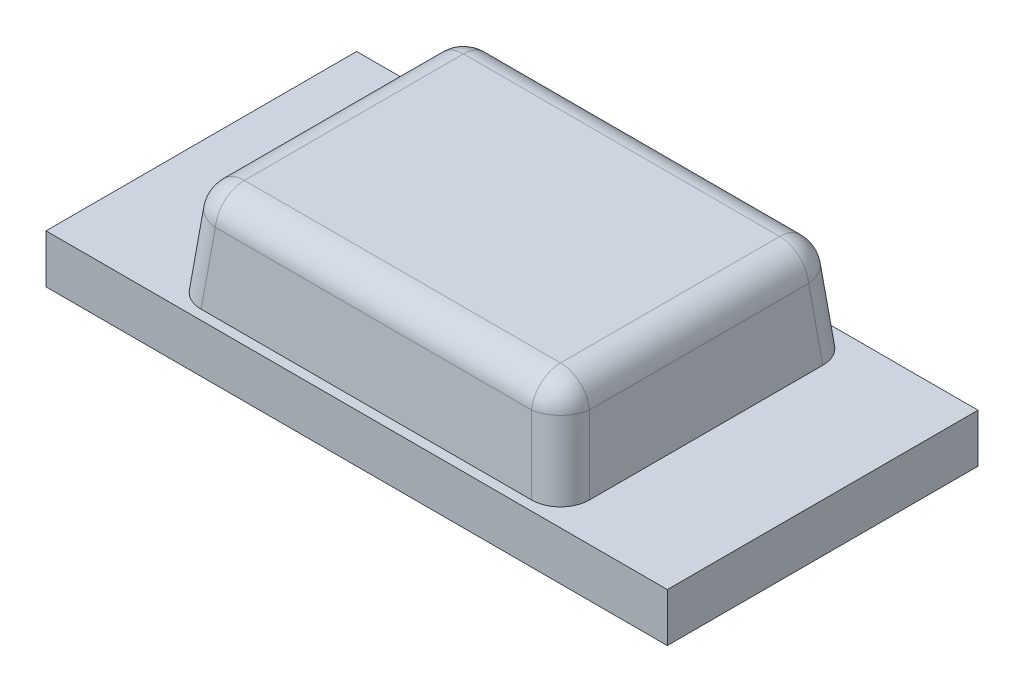
ISO-10303-21;
HEADER;
FILE_DESCRIPTION(('STEP AP214'),'2;1');
FILE_NAME('part.step','',(''),(''),'','','');
FILE_SCHEMA(('AUTOMOTIVE_DESIGN { 1 0 10303 214 1 1 1 1 }'));
ENDSEC;
DATA;
#1=APPLICATION_CONTEXT('core data for automotive mechanical design processes');
#2=APPLICATION_PROTOCOL_DEFINITION('international standard','automotive_design',2000,#1);
#3=PRODUCT_CONTEXT('',#1,'mechanical');
#4=PRODUCT('Part','Part','',(#3));
#5=PRODUCT_RELATED_PRODUCT_CATEGORY('part','',(#4));
#6=PRODUCT_DEFINITION_FORMATION('','',#4);
#7=PRODUCT_DEFINITION_CONTEXT('part definition',#1,'design');
#8=PRODUCT_DEFINITION('design','',#6,#7);
#9=PRODUCT_DEFINITION_SHAPE('','',#8);
#10=(LENGTH_UNIT() NAMED_UNIT(*) SI_UNIT(.MILLI.,.METRE.));
#11=(NAMED_UNIT(*) PLANE_ANGLE_UNIT() SI_UNIT($,.RADIAN.));
#12=(NAMED_UNIT(*) SI_UNIT($,.STERADIAN.) SOLID_ANGLE_UNIT());
#13=UNCERTAINTY_MEASURE_WITH_UNIT(LENGTH_MEASURE(1.E-05),#10,'distance_accuracy_value','');
#14=(GEOMETRIC_REPRESENTATION_CONTEXT(3) GLOBAL_UNCERTAINTY_ASSIGNED_CONTEXT((#13)) GLOBAL_UNIT_ASSIGNED_CONTEXT((#10,
#11,#12)) REPRESENTATION_CONTEXT('',''));
#15=CARTESIAN_POINT('',(0.,0.,0.));
#16=DIRECTION('',(0.,0.,1.));
#17=DIRECTION('',(1.,0.,0.));
#18=AXIS2_PLACEMENT_3D('',#15,#16,#17);
#19=CARTESIAN_POINT('',(-0.814255681,0.75,0.564255681));
#20=DIRECTION('',(0.,-1.,0.));
#21=DIRECTION('',(0.,0.,-1.));
#22=AXIS2_PLACEMENT_3D('',#19,#20,#21);
#23=PLANE('',#22);
#24=DIRECTION('',(-1.,0.,0.));
#25=VECTOR('',#24,1.);
#26=CARTESIAN_POINT('',(0.,0.75,0.564255680969235));
#27=LINE('',#26,#25);
#28=CARTESIAN_POINT('',(-0.814255681058048,0.749999999941955,0.56425568061731));
#29=VERTEX_POINT('',#28);
#30=CARTESIAN_POINT('',(0.814255680918878,0.750000000058046,0.564255680741093));
#31=VERTEX_POINT('',#30);
#32=EDGE_CURVE('E152',#29,#31,#27,.F.);
#33=ORIENTED_EDGE('',*,*,#32,.T.);
#34=DIRECTION('',(0.,0.,1.));
#35=VECTOR('',#34,1.);
#36=CARTESIAN_POINT('',(0.814255680969235,0.75,0.));
#37=LINE('',#36,#35);
#38=CARTESIAN_POINT('',(0.814255680984617,0.75,-0.564255681168272));
#39=VERTEX_POINT('',#38);
#40=EDGE_CURVE('E106',#31,#39,#37,.F.);
#41=ORIENTED_EDGE('',*,*,#40,.T.);
#42=DIRECTION('',(1.,0.,0.));
#43=VECTOR('',#42,1.);
#44=CARTESIAN_POINT('',(0.,0.75,-0.564255680969235));
#45=LINE('',#44,#43);
#46=CARTESIAN_POINT('',(-0.814255680934262,0.749999999941955,-0.56425568147571));
#47=VERTEX_POINT('',#46);
#48=EDGE_CURVE('E191',#39,#47,#45,.F.);
#49=ORIENTED_EDGE('',*,*,#48,.T.);
#50=DIRECTION('',(0.,0.,-1.));
#51=VECTOR('',#50,1.);
#52=CARTESIAN_POINT('',(-0.814255680969235,0.75,0.));
#53=LINE('',#52,#51);
#54=EDGE_CURVE('E163',#47,#29,#53,.F.);
#55=ORIENTED_EDGE('',*,*,#54,.T.);
#56=EDGE_LOOP('',(#33,#41,#49,#55));
#57=FACE_BOUND('',#56,.T.);
#58=ADVANCED_FACE('F17',(#57),#23,.F.);
#59=CARTESIAN_POINT('',(-1.6,0.,0.8));
#60=DIRECTION('',(0.,-1.,0.));
#61=DIRECTION('',(0.,0.,-1.));
#62=AXIS2_PLACEMENT_3D('',#59,#60,#61);
#63=PLANE('',#62);
#64=DIRECTION('',(0.,0.,-1.));
#65=VECTOR('',#64,1.);
#66=CARTESIAN_POINT('',(-1.6,0.,0.));
#67=LINE('',#66,#65);
#68=CARTESIAN_POINT('',(-1.6,0.,0.8));
#69=VERTEX_POINT('',#68);
#70=CARTESIAN_POINT('',(-1.6,0.,-0.8));
#71=VERTEX_POINT('',#70);
#72=EDGE_CURVE('E278',#69,#71,#67,.T.);
#73=ORIENTED_EDGE('',*,*,#72,.T.);
#74=DIRECTION('',(1.,0.,0.));
#75=VECTOR('',#74,1.);
#76=CARTESIAN_POINT('',(0.,0.,-0.8));
#77=LINE('',#76,#75);
#78=CARTESIAN_POINT('',(1.6,0.,-0.8));
#79=VERTEX_POINT('',#78);
#80=EDGE_CURVE('E272',#71,#79,#77,.T.);
#81=ORIENTED_EDGE('',*,*,#80,.T.);
#82=DIRECTION('',(0.,0.,1.));
#83=VECTOR('',#82,1.);
#84=CARTESIAN_POINT('',(1.6,0.,0.));
#85=LINE('',#84,#83);
#86=CARTESIAN_POINT('',(1.6,0.,0.8));
#87=VERTEX_POINT('',#86);
#88=EDGE_CURVE('E188',#79,#87,#85,.T.);
#89=ORIENTED_EDGE('',*,*,#88,.T.);
#90=DIRECTION('',(-1.,0.,0.));
#91=VECTOR('',#90,1.);
#92=CARTESIAN_POINT('',(0.,0.,0.8));
#93=LINE('',#92,#91);
#94=EDGE_CURVE('E105',#87,#69,#93,.T.);
#95=ORIENTED_EDGE('',*,*,#94,.T.);
#96=EDGE_LOOP('',(#73,#81,#89,#95));
#97=FACE_BOUND('',#96,.T.);
#98=ADVANCED_FACE('F181',(#97),#63,.T.);
#99=CARTESIAN_POINT('',(0.814255681232186,0.599999999767813,-0.564255681000003));
#100=DIRECTION('',(0.,-1.,0.));
#101=DIRECTION('',(0.,0.,-1.));
#102=AXIS2_PLACEMENT_3D('',#99,#100,#101);
#103=CIRCLE('',#102,0.15);
#104=TRIMMED_CURVE('',#103,(PARAMETER_VALUE(0.)),(PARAMETER_VALUE(3.14159265513768)),.T.,.PARAMETER.);
#105=CARTESIAN_POINT('',(0.814255681,0.6,-0.564255681));
#106=DIRECTION('',(0.,0.,1.));
#107=AXIS1_PLACEMENT('',#105,#106);
#108=SURFACE_OF_REVOLUTION('',#104,#107);
#109=CARTESIAN_POINT('',(0.814255681,0.6,-0.564255681));
#110=DIRECTION('',(1.,0.,0.));
#111=DIRECTION('',(0.,0.,-1.));
#112=AXIS2_PLACEMENT_3D('',#109,#110,#111);
#113=CIRCLE('',#112,0.15);
#114=CARTESIAN_POINT('',(0.814255680633374,0.614924012842646,-0.713511414020103));
#115=VERTEX_POINT('',#114);
#116=EDGE_CURVE('E102',#115,#39,#113,.T.);
#117=ORIENTED_EDGE('',*,*,#116,.T.);
#118=CARTESIAN_POINT('',(0.814255681,0.6,-0.564255681));
#119=DIRECTION('',(0.,0.,1.));
#120=DIRECTION('',(1.,0.,0.));
#121=AXIS2_PLACEMENT_3D('',#118,#119,#120);
#122=CIRCLE('',#121,0.15);
#123=CARTESIAN_POINT('',(0.96351141371124,0.614924015887899,-0.56425568128876));
#124=VERTEX_POINT('',#123);
#125=EDGE_CURVE('E98',#39,#124,#122,.F.);
#126=ORIENTED_EDGE('',*,*,#125,.T.);
#127=CARTESIAN_POINT('',(0.814255681158414,0.600000000306793,-0.564255681158414));
#128=DIRECTION('',(0.0990046045619691,-0.990149572817691,-0.0990046045619693));
#129=DIRECTION('',(0.,0.0994934181898311,-0.995038220239255));
#130=AXIS2_PLACEMENT_3D('',#127,#128,#129);
#131=CIRCLE('',#130,0.149999999935247);
#132=EDGE_CURVE('E21',#124,#115,#131,.F.);
#133=ORIENTED_EDGE('',*,*,#132,.T.);
#134=EDGE_LOOP('',(#117,#126,#133));
#135=FACE_BOUND('',#134,.T.);
#136=ADVANCED_FACE('F99',(#135),#108,.T.);
#137=CARTESIAN_POINT('',(-0.814255681,0.6,-0.564255681));
#138=DIRECTION('',(1.,0.,0.));
#139=DIRECTION('',(0.,1.,0.));
#140=AXIS2_PLACEMENT_3D('',#137,#138,#139);
#141=CYLINDRICAL_SURFACE('',#140,0.15);
#142=DIRECTION('',(1.,0.,0.));
#143=VECTOR('',#142,1.);
#144=CARTESIAN_POINT('',(0.,0.614924013,-0.713511414));
#145=LINE('',#144,#143);
#146=CARTESIAN_POINT('',(-0.814255680898972,0.614924011980278,-0.713511414326909));
#147=VERTEX_POINT('',#146);
#148=EDGE_CURVE('E89',#147,#115,#145,.T.);
#149=ORIENTED_EDGE('',*,*,#148,.F.);
#150=CARTESIAN_POINT('',(-0.814255680767813,0.599999999767819,-0.564255681464371));
#151=DIRECTION('',(1.,2.05103206470726E-10,0.));
#152=DIRECTION('',(0.,0.,-1.));
#153=AXIS2_PLACEMENT_3D('',#150,#151,#152);
#154=CIRCLE('',#153,0.15);
#155=EDGE_CURVE('E168',#147,#47,#154,.T.);
#156=ORIENTED_EDGE('',*,*,#155,.T.);
#157=ORIENTED_EDGE('',*,*,#48,.F.);
#158=ORIENTED_EDGE('',*,*,#116,.F.);
#159=EDGE_LOOP('',(#149,#156,#157,#158));
#160=FACE_BOUND('',#159,.T.);
#161=ADVANCED_FACE('F173',(#160),#141,.T.);
#162=CARTESIAN_POINT('',(-0.814255681232181,0.599999999767813,-0.564255681464371));
#163=DIRECTION('',(0.,-1.,0.));
#164=DIRECTION('',(0.,0.,-1.));
#165=AXIS2_PLACEMENT_3D('',#162,#163,#164);
#166=CIRCLE('',#165,0.15);
#167=TRIMMED_CURVE('',#166,(PARAMETER_VALUE(1.54786050643452E-09)),
(PARAMETER_VALUE(3.14159265204191)),.T.,.PARAMETER.);
#168=CARTESIAN_POINT('',(-0.814255681,0.6,-0.564255681));
#169=DIRECTION('',(0.,0.,1.));
#170=AXIS1_PLACEMENT('',#168,#169);
#171=SURFACE_OF_REVOLUTION('',#167,#170);
#172=CARTESIAN_POINT('',(-0.814255681338493,0.600000000342957,-0.564255681338493));
#173=DIRECTION('',(-0.0990046045609888,-0.990149572817887,-0.0990046045609883));
#174=DIRECTION('',(0.995038220239354,-0.0994934181888359,0.));
#175=AXIS2_PLACEMENT_3D('',#172,#173,#174);
#176=CIRCLE('',#175,0.149999999752651);
#177=CARTESIAN_POINT('',(-0.963511414083085,0.614924012877534,-0.564255681285929));
#178=VERTEX_POINT('',#177);
#179=EDGE_CURVE('E160',#147,#178,#176,.F.);
#180=ORIENTED_EDGE('',*,*,#179,.T.);
#181=CARTESIAN_POINT('',(-0.814255681,0.6,-0.564255681));
#182=DIRECTION('',(0.,0.,-1.));
#183=DIRECTION('',(-1.,0.,0.));
#184=AXIS2_PLACEMENT_3D('',#181,#182,#183);
#185=CIRCLE('',#184,0.15);
#186=EDGE_CURVE('E153',#178,#47,#185,.T.);
#187=ORIENTED_EDGE('',*,*,#186,.T.);
#188=ORIENTED_EDGE('',*,*,#155,.F.);
#189=EDGE_LOOP('',(#180,#187,#188));
#190=FACE_BOUND('',#189,.T.);
#191=ADVANCED_FACE('F170',(#190),#171,.T.);
#192=CARTESIAN_POINT('',(-0.814255681,0.6,0.564255681));
#193=DIRECTION('',(0.,0.,-1.));
#194=DIRECTION('',(-1.,0.,0.));
#195=AXIS2_PLACEMENT_3D('',#192,#193,#194);
#196=CYLINDRICAL_SURFACE('',#195,0.15);
#197=DIRECTION('',(0.,0.,-1.));
#198=VECTOR('',#197,1.);
#199=CARTESIAN_POINT('',(-0.963511414,0.614924013,0.));
#200=LINE('',#199,#198);
#201=CARTESIAN_POINT('',(-0.963511413796526,0.614924012631087,0.564255683016812));
#202=VERTEX_POINT('',#201);
#203=EDGE_CURVE('E156',#202,#178,#200,.T.);
#204=ORIENTED_EDGE('',*,*,#203,.F.);
#205=CARTESIAN_POINT('',(-0.814255681,0.6,0.56425567953077));
#206=DIRECTION('',(0.,0.,1.));
#207=DIRECTION('',(1.,1.54793351408977E-09,0.));
#208=AXIS2_PLACEMENT_3D('',#205,#206,#207);
#209=CIRCLE('',#208,0.149999999767819);
#210=EDGE_CURVE('E149',#202,#29,#209,.F.);
#211=ORIENTED_EDGE('',*,*,#210,.T.);
#212=ORIENTED_EDGE('',*,*,#54,.F.);
#213=ORIENTED_EDGE('',*,*,#186,.F.);
#214=EDGE_LOOP('',(#204,#211,#212,#213));
#215=FACE_BOUND('',#214,.T.);
#216=ADVANCED_FACE('F141',(#215),#196,.T.);
#217=CARTESIAN_POINT('',(-0.814255681232181,0.60000000023219,0.564255681000002));
#218=DIRECTION('',(0.,-1.,0.));
#219=DIRECTION('',(0.,0.,-1.));
#220=AXIS2_PLACEMENT_3D('',#217,#218,#219);
#221=CIRCLE('',#220,0.15);
#222=TRIMMED_CURVE('',#221,(PARAMETER_VALUE(1.54786050643452E-09)),
(PARAMETER_VALUE(3.14159265204191)),.T.,.PARAMETER.);
#223=CARTESIAN_POINT('',(-0.814255681,0.6,0.564255681));
#224=DIRECTION('',(0.,0.,1.));
#225=AXIS1_PLACEMENT('',#223,#224);
#226=SURFACE_OF_REVOLUTION('',#222,#225);
#227=CARTESIAN_POINT('',(-0.814255680755352,0.599999999675962,0.564255680755352));
#228=DIRECTION('',(-0.0990046045619691,-0.990149572817691,0.0990046045619691));
#229=DIRECTION('',(0.,-0.0994934181898309,-0.995038220239255));
#230=AXIS2_PLACEMENT_3D('',#227,#228,#229);
#231=CIRCLE('',#230,0.149999999533791);
#232=CARTESIAN_POINT('',(-0.814255683415363,0.614924012657866,0.713511413665788));
#233=VERTEX_POINT('',#232);
#234=EDGE_CURVE('E228',#202,#233,#231,.F.);
#235=ORIENTED_EDGE('',*,*,#234,.T.);
#236=CARTESIAN_POINT('',(-0.814255681,0.6,0.564255681));
#237=DIRECTION('',(-1.,0.,0.));
#238=DIRECTION('',(0.,0.,1.));
#239=AXIS2_PLACEMENT_3D('',#236,#237,#238);
#240=CIRCLE('',#239,0.15);
#241=EDGE_CURVE('E198',#233,#29,#240,.T.);
#242=ORIENTED_EDGE('',*,*,#241,.T.);
#243=ORIENTED_EDGE('',*,*,#210,.F.);
#244=EDGE_LOOP('',(#235,#242,#243));
#245=FACE_BOUND('',#244,.T.);
#246=ADVANCED_FACE('F136',(#245),#226,.T.);
#247=CARTESIAN_POINT('',(0.814255681,0.6,0.564255681));
#248=DIRECTION('',(-1.,0.,0.));
#249=DIRECTION('',(0.,-1.,0.));
#250=AXIS2_PLACEMENT_3D('',#247,#248,#249);
#251=CYLINDRICAL_SURFACE('',#250,0.15);
#252=DIRECTION('',(-1.,0.,0.));
#253=VECTOR('',#252,1.);
#254=CARTESIAN_POINT('',(0.,0.614924013,0.713511414));
#255=LINE('',#254,#253);
#256=CARTESIAN_POINT('',(0.814255683476164,0.614924012663885,0.713511413665186));
#257=VERTEX_POINT('',#256);
#258=EDGE_CURVE('E227',#257,#233,#255,.T.);
#259=ORIENTED_EDGE('',*,*,#258,.F.);
#260=CARTESIAN_POINT('',(0.81425568076781,0.600000000232186,0.564255681464368));
#261=DIRECTION('',(1.,2.05103206470726E-10,0.));
#262=DIRECTION('',(0.,0.,-1.));
#263=AXIS2_PLACEMENT_3D('',#260,#261,#262);
#264=CIRCLE('',#263,0.15);
#265=EDGE_CURVE('E118',#257,#31,#264,.F.);
#266=ORIENTED_EDGE('',*,*,#265,.T.);
#267=ORIENTED_EDGE('',*,*,#32,.F.);
#268=ORIENTED_EDGE('',*,*,#241,.F.);
#269=EDGE_LOOP('',(#259,#266,#267,#268));
#270=FACE_BOUND('',#269,.T.);
#271=ADVANCED_FACE('F131',(#270),#251,.T.);
#272=CARTESIAN_POINT('',(0.814255681232186,0.60000000023219,0.564255681464368));
#273=DIRECTION('',(0.,-1.,0.));
#274=DIRECTION('',(0.,0.,-1.));
#275=AXIS2_PLACEMENT_3D('',#272,#273,#274);
#276=CIRCLE('',#275,0.15);
#277=TRIMMED_CURVE('',#276,(PARAMETER_VALUE(0.)),(PARAMETER_VALUE(3.14159265513768)),.T.,.PARAMETER.);
#278=CARTESIAN_POINT('',(0.814255681,0.6,0.564255681));
#279=DIRECTION('',(0.,0.,1.));
#280=AXIS1_PLACEMENT('',#278,#279);
#281=SURFACE_OF_REVOLUTION('',#277,#280);
#282=CARTESIAN_POINT('',(0.814255681,0.6,0.564255681));
#283=DIRECTION('',(0.,0.,1.));
#284=DIRECTION('',(1.,0.,0.));
#285=AXIS2_PLACEMENT_3D('',#282,#283,#284);
#286=CIRCLE('',#285,0.15);
#287=CARTESIAN_POINT('',(0.963511413847012,0.614924012709589,0.564255683751427));
#288=VERTEX_POINT('',#287);
#289=EDGE_CURVE('E110',#288,#31,#286,.T.);
#290=ORIENTED_EDGE('',*,*,#289,.T.);
#291=ORIENTED_EDGE('',*,*,#265,.F.);
#292=CARTESIAN_POINT('',(0.814255680755352,0.599999999675962,0.564255680755352));
#293=DIRECTION('',(0.0990046045619691,-0.990149572817691,0.0990046045619691));
#294=DIRECTION('',(0.995038220239255,0.0994934181898309,0.));
#295=AXIS2_PLACEMENT_3D('',#292,#293,#294);
#296=CIRCLE('',#295,0.149999999533791);
#297=EDGE_CURVE('E95',#257,#288,#296,.F.);
#298=ORIENTED_EDGE('',*,*,#297,.T.);
#299=EDGE_LOOP('',(#290,#291,#298));
#300=FACE_BOUND('',#299,.T.);
#301=ADVANCED_FACE('F127',(#300),#281,.T.);
#302=CARTESIAN_POINT('',(0.814255681,0.6,-0.564255681));
#303=DIRECTION('',(0.,0.,1.));
#304=DIRECTION('',(1.,0.,0.));
#305=AXIS2_PLACEMENT_3D('',#302,#303,#304);
#306=CYLINDRICAL_SURFACE('',#305,0.15);
#307=ORIENTED_EDGE('',*,*,#40,.F.);
#308=ORIENTED_EDGE('',*,*,#289,.F.);
#309=DIRECTION('',(0.,0.,1.));
#310=VECTOR('',#309,1.);
#311=CARTESIAN_POINT('',(0.963511414,0.614924013,0.));
#312=LINE('',#311,#310);
#313=EDGE_CURVE('E93',#124,#288,#312,.T.);
#314=ORIENTED_EDGE('',*,*,#313,.F.);
#315=ORIENTED_EDGE('',*,*,#125,.F.);
#316=EDGE_LOOP('',(#307,#308,#314,#315));
#317=FACE_BOUND('',#316,.T.);
#318=ADVANCED_FACE('F108',(#317),#306,.T.);
#319=CARTESIAN_POINT('',(1.6,0.,0.8));
#320=DIRECTION('',(0.,0.,-1.));
#321=DIRECTION('',(-1.,0.,0.));
#322=AXIS2_PLACEMENT_3D('',#319,#320,#321);
#323=PLANE('',#322);
#324=DIRECTION('',(0.,1.,0.));
#325=VECTOR('',#324,1.);
#326=CARTESIAN_POINT('',(1.6,0.125,0.8));
#327=LINE('',#326,#325);
#328=CARTESIAN_POINT('',(1.6,0.25,0.8));
#329=VERTEX_POINT('',#328);
#330=EDGE_CURVE('E269',#87,#329,#327,.T.);
#331=ORIENTED_EDGE('',*,*,#330,.T.);
#332=DIRECTION('',(-1.,0.,0.));
#333=VECTOR('',#332,1.);
#334=CARTESIAN_POINT('',(0.,0.25,0.8));
#335=LINE('',#334,#333);
#336=CARTESIAN_POINT('',(-1.6,0.25,0.8));
#337=VERTEX_POINT('',#336);
#338=EDGE_CURVE('E112',#329,#337,#335,.T.);
#339=ORIENTED_EDGE('',*,*,#338,.T.);
#340=DIRECTION('',(0.,-1.,0.));
#341=VECTOR('',#340,1.);
#342=CARTESIAN_POINT('',(-1.6,0.125,0.8));
#343=LINE('',#342,#341);
#344=EDGE_CURVE('E280',#337,#69,#343,.T.);
#345=ORIENTED_EDGE('',*,*,#344,.T.);
#346=ORIENTED_EDGE('',*,*,#94,.F.);
#347=EDGE_LOOP('',(#331,#339,#345,#346));
#348=FACE_BOUND('',#347,.T.);
#349=ADVANCED_FACE('F320',(#348),#323,.F.);
#350=CARTESIAN_POINT('',(-1.6,0.,0.8));
#351=DIRECTION('',(1.,0.,0.));
#352=DIRECTION('',(0.,0.,-1.));
#353=AXIS2_PLACEMENT_3D('',#350,#351,#352);
#354=PLANE('',#353);
#355=ORIENTED_EDGE('',*,*,#344,.F.);
#356=DIRECTION('',(0.,0.,-1.));
#357=VECTOR('',#356,1.);
#358=CARTESIAN_POINT('',(-1.6,0.25,0.));
#359=LINE('',#358,#357);
#360=CARTESIAN_POINT('',(-1.6,0.25,-0.8));
#361=VERTEX_POINT('',#360);
#362=EDGE_CURVE('E304',#337,#361,#359,.T.);
#363=ORIENTED_EDGE('',*,*,#362,.T.);
#364=DIRECTION('',(0.,-1.,0.));
#365=VECTOR('',#364,1.);
#366=CARTESIAN_POINT('',(-1.6,0.125,-0.8));
#367=LINE('',#366,#365);
#368=EDGE_CURVE('E275',#361,#71,#367,.T.);
#369=ORIENTED_EDGE('',*,*,#368,.T.);
#370=ORIENTED_EDGE('',*,*,#72,.F.);
#371=EDGE_LOOP('',(#355,#363,#369,#370));
#372=FACE_BOUND('',#371,.T.);
#373=ADVANCED_FACE('F298',(#372),#354,.F.);
#374=CARTESIAN_POINT('',(-1.6,0.,-0.8));
#375=DIRECTION('',(0.,0.,1.));
#376=DIRECTION('',(1.,0.,0.));
#377=AXIS2_PLACEMENT_3D('',#374,#375,#376);
#378=PLANE('',#377);
#379=ORIENTED_EDGE('',*,*,#368,.F.);
#380=DIRECTION('',(1.,0.,0.));
#381=VECTOR('',#380,1.);
#382=CARTESIAN_POINT('',(0.,0.25,-0.8));
#383=LINE('',#382,#381);
#384=CARTESIAN_POINT('',(1.6,0.25,-0.8));
#385=VERTEX_POINT('',#384);
#386=EDGE_CURVE('E310',#361,#385,#383,.T.);
#387=ORIENTED_EDGE('',*,*,#386,.T.);
#388=DIRECTION('',(0.,-1.,0.));
#389=VECTOR('',#388,1.);
#390=CARTESIAN_POINT('',(1.6,0.125,-0.8));
#391=LINE('',#390,#389);
#392=EDGE_CURVE('E90',#385,#79,#391,.T.);
#393=ORIENTED_EDGE('',*,*,#392,.T.);
#394=ORIENTED_EDGE('',*,*,#80,.F.);
#395=EDGE_LOOP('',(#379,#387,#393,#394));
#396=FACE_BOUND('',#395,.T.);
#397=ADVANCED_FACE('F309',(#396),#378,.F.);
#398=CARTESIAN_POINT('',(1.6,0.,-0.8));
#399=DIRECTION('',(-1.,0.,0.));
#400=DIRECTION('',(0.,0.,1.));
#401=AXIS2_PLACEMENT_3D('',#398,#399,#400);
#402=PLANE('',#401);
#403=ORIENTED_EDGE('',*,*,#392,.F.);
#404=DIRECTION('',(0.,0.,1.));
#405=VECTOR('',#404,1.);
#406=CARTESIAN_POINT('',(1.6,0.25,0.));
#407=LINE('',#406,#405);
#408=EDGE_CURVE('E221',#385,#329,#407,.T.);
#409=ORIENTED_EDGE('',*,*,#408,.T.);
#410=ORIENTED_EDGE('',*,*,#330,.F.);
#411=ORIENTED_EDGE('',*,*,#88,.F.);
#412=EDGE_LOOP('',(#403,#409,#410,#411));
#413=FACE_BOUND('',#412,.T.);
#414=ADVANCED_FACE('F378',(#413),#402,.F.);
#415=CARTESIAN_POINT('',(0.814255681158414,0.600000000306793,-0.564255681158414));
#416=DIRECTION('',(0.0990046045619691,-0.990149572817691,-0.0990046045619693));
#417=DIRECTION('',(0.,0.0994934181898311,-0.995038220239255));
#418=AXIS2_PLACEMENT_3D('',#415,#416,#417);
#419=CYLINDRICAL_SURFACE('',#418,0.149999999935247);
#420=DIRECTION('',(0.0990046054971581,-0.990149572660435,-0.0990046051995037));
#421=VECTOR('',#420,1.);
#422=CARTESIAN_POINT('',(0.814255680266748,0.614924013,-0.713511414));
#423=LINE('',#422,#421);
#424=CARTESIAN_POINT('',(0.850744266648492,0.25,-0.749999999945995));
#425=VERTEX_POINT('',#424);
#426=EDGE_CURVE('E85',#115,#425,#423,.T.);
#427=ORIENTED_EDGE('',*,*,#426,.F.);
#428=ORIENTED_EDGE('',*,*,#132,.F.);
#429=DIRECTION('',(-0.0990046052310662,0.990149572976097,0.0990046023086504));
#430=VECTOR('',#429,1.);
#431=CARTESIAN_POINT('',(1.,0.25,-0.60074426650045));
#432=LINE('',#431,#430);
#433=CARTESIAN_POINT('',(0.999999999986633,0.249999999998663,-0.600744266762781));
#434=VERTEX_POINT('',#433);
#435=EDGE_CURVE('E84',#434,#124,#432,.T.);
#436=ORIENTED_EDGE('',*,*,#435,.F.);
#437=CARTESIAN_POINT('',(0.849252021689526,0.25,-0.599252021689526));
#438=DIRECTION('',(0.,-1.,0.));
#439=DIRECTION('',(0.707106781186547,0.,-0.707106781186548));
#440=AXIS2_PLACEMENT_3D('',#437,#438,#439);
#441=ELLIPSE('',#440,0.151492263444995,0.149999999935247);
#442=EDGE_CURVE('E220',#434,#425,#441,.F.);
#443=ORIENTED_EDGE('',*,*,#442,.T.);
#444=EDGE_LOOP('',(#427,#428,#436,#443));
#445=FACE_BOUND('',#444,.T.);
#446=ADVANCED_FACE('F82',(#445),#419,.T.);
#447=CARTESIAN_POINT('',(-0.860953198,0.25,-0.75));
#448=DIRECTION('',(0.,0.0994934188398162,-0.995038220174263));
#449=DIRECTION('',(0.,0.995038220174263,0.0994934188398162));
#450=AXIS2_PLACEMENT_3D('',#447,#448,#449);
#451=PLANE('',#450);
#452=ORIENTED_EDGE('',*,*,#148,.T.);
#453=ORIENTED_EDGE('',*,*,#426,.T.);
#454=DIRECTION('',(-1.,0.,0.));
#455=VECTOR('',#454,1.);
#456=CARTESIAN_POINT('',(0.,0.25,-0.75));
#457=LINE('',#456,#455);
#458=CARTESIAN_POINT('',(-0.850744267073968,0.25,-0.749999999955323));
#459=VERTEX_POINT('',#458);
#460=EDGE_CURVE('E219',#425,#459,#457,.T.);
#461=ORIENTED_EDGE('',*,*,#460,.T.);
#462=DIRECTION('',(-0.099004605252526,-0.990149572679594,-0.0990046052525263));
#463=VECTOR('',#462,1.);
#464=CARTESIAN_POINT('',(-0.832915133026806,0.428309982502654,-0.732170865999735));
#465=LINE('',#464,#463);
#466=EDGE_CURVE('E234',#459,#147,#465,.F.);
#467=ORIENTED_EDGE('',*,*,#466,.T.);
#468=EDGE_LOOP('',(#452,#453,#461,#467));
#469=FACE_BOUND('',#468,.T.);
#470=ADVANCED_FACE('F351',(#469),#451,.T.);
#471=CARTESIAN_POINT('',(-0.814255681338493,0.600000000342956,-0.564255681338493));
#472=DIRECTION('',(-0.0990046045609888,-0.990149572817887,-0.0990046045609883));
#473=DIRECTION('',(0.995038220239354,-0.0994934181888359,0.));
#474=AXIS2_PLACEMENT_3D('',#471,#472,#473);
#475=CYLINDRICAL_SURFACE('',#474,0.149999999752651);
#476=DIRECTION('',(-0.0990046052310662,-0.990149572976097,-0.0990046023086504));
#477=VECTOR('',#476,1.);
#478=CARTESIAN_POINT('',(-0.963511414,0.614924013,-0.564255681577519));
#479=LINE('',#478,#477);
#480=CARTESIAN_POINT('',(-0.999999999945905,0.25,-0.60074426680124));
#481=VERTEX_POINT('',#480);
#482=EDGE_CURVE('E159',#178,#481,#479,.T.);
#483=ORIENTED_EDGE('',*,*,#482,.F.);
#484=ORIENTED_EDGE('',*,*,#179,.F.);
#485=ORIENTED_EDGE('',*,*,#466,.F.);
#486=CARTESIAN_POINT('',(-0.849252021872867,0.25,-0.599252021872867));
#487=DIRECTION('',(0.,-1.,0.));
#488=DIRECTION('',(-0.707106781186549,0.,-0.707106781186546));
#489=AXIS2_PLACEMENT_3D('',#486,#487,#488);
#490=ELLIPSE('',#489,0.151492263260552,0.149999999752651);
#491=EDGE_CURVE('E216',#459,#481,#490,.F.);
#492=ORIENTED_EDGE('',*,*,#491,.T.);
#493=EDGE_LOOP('',(#483,#484,#485,#492));
#494=FACE_BOUND('',#493,.T.);
#495=ADVANCED_FACE('F355',(#494),#475,.T.);
#496=CARTESIAN_POINT('',(-0.963511414,0.614924013,-0.607953198));
#497=DIRECTION('',(-0.995038220174263,0.0994934188398159,0.));
#498=DIRECTION('',(-0.0994934188398159,-0.995038220174263,0.));
#499=AXIS2_PLACEMENT_3D('',#496,#497,#498);
#500=PLANE('',#499);
#501=DIRECTION('',(0.,0.,1.));
#502=VECTOR('',#501,1.);
#503=CARTESIAN_POINT('',(-1.,0.25,0.));
#504=LINE('',#503,#502);
#505=CARTESIAN_POINT('',(-0.999999999225994,0.249999999971483,0.600744266789597));
#506=VERTEX_POINT('',#505);
#507=EDGE_CURVE('E215',#481,#506,#504,.T.);
#508=ORIENTED_EDGE('',*,*,#507,.T.);
#509=DIRECTION('',(-0.099004603592526,-0.990149572819573,0.0990046055125915));
#510=VECTOR('',#509,1.);
#511=CARTESIAN_POINT('',(-0.98217086514332,0.428309982370828,0.582915133067153));
#512=LINE('',#511,#510);
#513=EDGE_CURVE('E231',#506,#202,#512,.F.);
#514=ORIENTED_EDGE('',*,*,#513,.T.);
#515=ORIENTED_EDGE('',*,*,#203,.T.);
#516=ORIENTED_EDGE('',*,*,#482,.T.);
#517=EDGE_LOOP('',(#508,#514,#515,#516));
#518=FACE_BOUND('',#517,.T.);
#519=ADVANCED_FACE('F258',(#518),#500,.T.);
#520=CARTESIAN_POINT('',(-0.814255680755352,0.599999999675962,0.564255680755352));
#521=DIRECTION('',(-0.0990046045619691,-0.990149572817691,0.0990046045619691));
#522=DIRECTION('',(0.,-0.0994934181898309,-0.995038220239255));
#523=AXIS2_PLACEMENT_3D('',#520,#521,#522);
#524=CYLINDRICAL_SURFACE('',#523,0.149999999533791);
#525=DIRECTION('',(-0.0990046054971572,-0.990149572660435,0.0990046051995037));
#526=VECTOR('',#525,1.);
#527=CARTESIAN_POINT('',(-0.814255680266748,0.614924013,0.713511414));
#528=LINE('',#527,#526);
#529=CARTESIAN_POINT('',(-0.850744266413426,0.25,0.749999999511198));
#530=VERTEX_POINT('',#529);
#531=EDGE_CURVE('E225',#233,#530,#528,.T.);
#532=ORIENTED_EDGE('',*,*,#531,.F.);
#533=ORIENTED_EDGE('',*,*,#234,.F.);
#534=ORIENTED_EDGE('',*,*,#513,.F.);
#535=CARTESIAN_POINT('',(-0.849252021223388,0.25,0.599252021223388));
#536=DIRECTION('',(0.,-1.,0.));
#537=DIRECTION('',(-0.707106781186547,0.,0.707106781186548));
#538=AXIS2_PLACEMENT_3D('',#535,#536,#537);
#539=ELLIPSE('',#538,0.151492263039545,0.149999999533791);
#540=EDGE_CURVE('E212',#506,#530,#539,.F.);
#541=ORIENTED_EDGE('',*,*,#540,.T.);
#542=EDGE_LOOP('',(#532,#533,#534,#541));
#543=FACE_BOUND('',#542,.T.);
#544=ADVANCED_FACE('F363',(#543),#524,.T.);
#545=CARTESIAN_POINT('',(-0.860953198,0.614924013,0.713511414));
#546=DIRECTION('',(0.,0.0994934188398162,0.995038220174263));
#547=DIRECTION('',(0.,-0.995038220174263,0.0994934188398162));
#548=AXIS2_PLACEMENT_3D('',#545,#546,#547);
#549=PLANE('',#548);
#550=ORIENTED_EDGE('',*,*,#258,.T.);
#551=ORIENTED_EDGE('',*,*,#531,.T.);
#552=DIRECTION('',(1.,0.,0.));
#553=VECTOR('',#552,1.);
#554=CARTESIAN_POINT('',(0.,0.25,0.75));
#555=LINE('',#554,#553);
#556=CARTESIAN_POINT('',(0.850744266123877,0.249999999971483,0.749999999225994));
#557=VERTEX_POINT('',#556);
#558=EDGE_CURVE('E211',#530,#557,#555,.T.);
#559=ORIENTED_EDGE('',*,*,#558,.T.);
#560=DIRECTION('',(0.0990046036113469,-0.990149573007796,0.0990046036113463));
#561=VECTOR('',#560,1.);
#562=CARTESIAN_POINT('',(0.832915132091147,0.428309982274204,0.732170865152982));
#563=LINE('',#562,#561);
#564=EDGE_CURVE('E224',#557,#257,#563,.F.);
#565=ORIENTED_EDGE('',*,*,#564,.T.);
#566=EDGE_LOOP('',(#550,#551,#559,#565));
#567=FACE_BOUND('',#566,.T.);
#568=ADVANCED_FACE('F341',(#567),#549,.T.);
#569=CARTESIAN_POINT('',(0.814255680755352,0.599999999675962,0.564255680755352));
#570=DIRECTION('',(0.0990046045619691,-0.990149572817691,0.0990046045619691));
#571=DIRECTION('',(0.995038220239255,0.0994934181898309,0.));
#572=AXIS2_PLACEMENT_3D('',#569,#570,#571);
#573=CYLINDRICAL_SURFACE('',#572,0.149999999533791);
#574=DIRECTION('',(0.0990046052310662,-0.990149572976097,0.0990046023086501));
#575=VECTOR('',#574,1.);
#576=CARTESIAN_POINT('',(0.963511414,0.614924013,0.564255681577519));
#577=LINE('',#576,#575);
#578=CARTESIAN_POINT('',(0.999999999511197,0.25,0.600744266475426));
#579=VERTEX_POINT('',#578);
#580=EDGE_CURVE('E35',#288,#579,#577,.T.);
#581=ORIENTED_EDGE('',*,*,#580,.F.);
#582=ORIENTED_EDGE('',*,*,#297,.F.);
#583=ORIENTED_EDGE('',*,*,#564,.F.);
#584=CARTESIAN_POINT('',(0.849252021223388,0.25,0.599252021223388));
#585=DIRECTION('',(0.,-1.,0.));
#586=DIRECTION('',(0.707106781186548,0.,0.707106781186547));
#587=AXIS2_PLACEMENT_3D('',#584,#585,#586);
#588=ELLIPSE('',#587,0.151492263039545,0.149999999533791);
#589=EDGE_CURVE('E27',#557,#579,#588,.F.);
#590=ORIENTED_EDGE('',*,*,#589,.T.);
#591=EDGE_LOOP('',(#581,#582,#583,#590));
#592=FACE_BOUND('',#591,.T.);
#593=ADVANCED_FACE('F346',(#592),#573,.T.);
#594=CARTESIAN_POINT('',(1.,0.25,-0.607953198));
#595=DIRECTION('',(0.995038220174263,0.0994934188398159,0.));
#596=DIRECTION('',(-0.0994934188398159,0.995038220174263,0.));
#597=AXIS2_PLACEMENT_3D('',#594,#595,#596);
#598=PLANE('',#597);
#599=ORIENTED_EDGE('',*,*,#313,.T.);
#600=ORIENTED_EDGE('',*,*,#580,.T.);
#601=DIRECTION('',(0.,0.,-1.));
#602=VECTOR('',#601,1.);
#603=CARTESIAN_POINT('',(1.,0.25,0.));
#604=LINE('',#603,#602);
#605=EDGE_CURVE('E11',#579,#434,#604,.T.);
#606=ORIENTED_EDGE('',*,*,#605,.T.);
#607=ORIENTED_EDGE('',*,*,#435,.T.);
#608=EDGE_LOOP('',(#599,#600,#606,#607));
#609=FACE_BOUND('',#608,.T.);
#610=ADVANCED_FACE('F91',(#609),#598,.T.);
#611=CARTESIAN_POINT('',(-1.6,0.25,0.8));
#612=DIRECTION('',(0.,-1.,0.));
#613=DIRECTION('',(0.,0.,-1.));
#614=AXIS2_PLACEMENT_3D('',#611,#612,#613);
#615=PLANE('',#614);
#616=ORIENTED_EDGE('',*,*,#589,.F.);
#617=ORIENTED_EDGE('',*,*,#558,.F.);
#618=ORIENTED_EDGE('',*,*,#540,.F.);
#619=ORIENTED_EDGE('',*,*,#507,.F.);
#620=ORIENTED_EDGE('',*,*,#491,.F.);
#621=ORIENTED_EDGE('',*,*,#460,.F.);
#622=ORIENTED_EDGE('',*,*,#442,.F.);
#623=ORIENTED_EDGE('',*,*,#605,.F.);
#624=EDGE_LOOP('',(#616,#617,#618,#619,#620,#621,#622,#623));
#625=FACE_BOUND('',#624,.T.);
#626=ORIENTED_EDGE('',*,*,#386,.F.);
#627=ORIENTED_EDGE('',*,*,#362,.F.);
#628=ORIENTED_EDGE('',*,*,#338,.F.);
#629=ORIENTED_EDGE('',*,*,#408,.F.);
#630=EDGE_LOOP('',(#626,#627,#628,#629));
#631=FACE_BOUND('',#630,.T.);
#632=ADVANCED_FACE('F19',(#625,#631),#615,.F.);
#633=CLOSED_SHELL('',(#58,#98,#136,#161,#191,#216,#246,#271,#301,#318,#349,#373,#397,#414,#446,
#470,#495,#519,#544,#568,#593,#610,#632));
#634=MANIFOLD_SOLID_BREP('B1',#633);
#635=ADVANCED_BREP_SHAPE_REPRESENTATION('',(#18,#634),#14);
#636=SHAPE_DEFINITION_REPRESENTATION(#9,#635);
ENDSEC;
END-ISO-10303-21;
